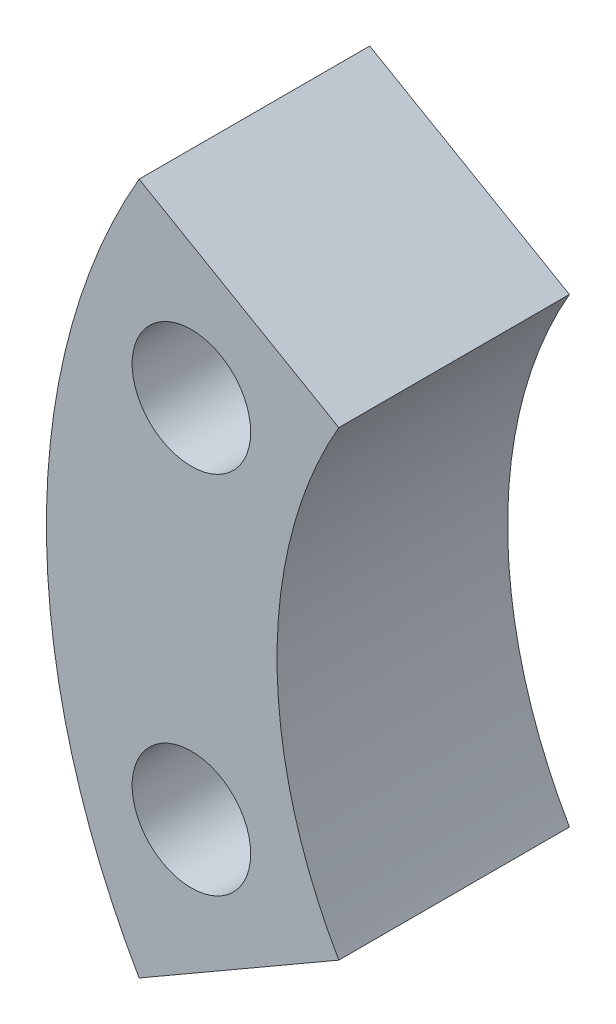
ISO-10303-21;
HEADER;
FILE_DESCRIPTION(('STEP AP214'),'2;1');
FILE_NAME('part.step','',(''),(''),'','','');
FILE_SCHEMA(('AUTOMOTIVE_DESIGN { 1 0 10303 214 1 1 1 1 }'));
ENDSEC;
DATA;
#1=APPLICATION_CONTEXT('core data for automotive mechanical design processes');
#2=APPLICATION_PROTOCOL_DEFINITION('international standard','automotive_design',2000,#1);
#3=PRODUCT_CONTEXT('',#1,'mechanical');
#4=PRODUCT('Part','Part','',(#3));
#5=PRODUCT_RELATED_PRODUCT_CATEGORY('part','',(#4));
#6=PRODUCT_DEFINITION_FORMATION('','',#4);
#7=PRODUCT_DEFINITION_CONTEXT('part definition',#1,'design');
#8=PRODUCT_DEFINITION('design','',#6,#7);
#9=PRODUCT_DEFINITION_SHAPE('','',#8);
#10=(LENGTH_UNIT() NAMED_UNIT(*) SI_UNIT(.MILLI.,.METRE.));
#11=(NAMED_UNIT(*) PLANE_ANGLE_UNIT() SI_UNIT($,.RADIAN.));
#12=(NAMED_UNIT(*) SI_UNIT($,.STERADIAN.) SOLID_ANGLE_UNIT());
#13=UNCERTAINTY_MEASURE_WITH_UNIT(LENGTH_MEASURE(1.E-05),#10,'distance_accuracy_value','');
#14=(GEOMETRIC_REPRESENTATION_CONTEXT(3) GLOBAL_UNCERTAINTY_ASSIGNED_CONTEXT((#13)) GLOBAL_UNIT_ASSIGNED_CONTEXT((#10,
#11,#12)) REPRESENTATION_CONTEXT('',''));
#15=CARTESIAN_POINT('',(0.,0.,0.));
#16=DIRECTION('',(0.,0.,1.));
#17=DIRECTION('',(1.,0.,0.));
#18=AXIS2_PLACEMENT_3D('',#15,#16,#17);
#19=CARTESIAN_POINT('',(0.,0.,6.35));
#20=DIRECTION('',(0.,0.,-1.));
#21=DIRECTION('',(-1.,0.,0.));
#22=AXIS2_PLACEMENT_3D('',#19,#20,#21);
#23=CYLINDRICAL_SURFACE('',#22,19.05);
#24=CARTESIAN_POINT('',(0.,0.,0.));
#25=DIRECTION('',(0.,0.,1.));
#26=DIRECTION('',(1.,0.,0.));
#27=AXIS2_PLACEMENT_3D('',#24,#25,#26);
#28=CIRCLE('',#27,19.05);
#29=CARTESIAN_POINT('',(-16.4977839420936,9.525,0.));
#30=VERTEX_POINT('',#29);
#31=CARTESIAN_POINT('',(-16.4977839420936,-9.525,0.));
#32=VERTEX_POINT('',#31);
#33=EDGE_CURVE('E113',#30,#32,#28,.T.);
#34=ORIENTED_EDGE('',*,*,#33,.T.);
#35=DIRECTION('',(0.,0.,-1.));
#36=VECTOR('',#35,1.);
#37=CARTESIAN_POINT('',(-16.4977839420936,-9.525,6.35));
#38=LINE('',#37,#36);
#39=CARTESIAN_POINT('',(-16.4977839420936,-9.525,6.35));
#40=VERTEX_POINT('',#39);
#41=EDGE_CURVE('E11',#40,#32,#38,.T.);
#42=ORIENTED_EDGE('',*,*,#41,.F.);
#43=CARTESIAN_POINT('',(0.,0.,6.35));
#44=DIRECTION('',(0.,0.,1.));
#45=DIRECTION('',(1.,0.,0.));
#46=AXIS2_PLACEMENT_3D('',#43,#44,#45);
#47=CIRCLE('',#46,19.05);
#48=CARTESIAN_POINT('',(-16.4977839420936,9.525,6.35));
#49=VERTEX_POINT('',#48);
#50=EDGE_CURVE('E97',#49,#40,#47,.T.);
#51=ORIENTED_EDGE('',*,*,#50,.F.);
#52=DIRECTION('',(0.,0.,-1.));
#53=VECTOR('',#52,1.);
#54=CARTESIAN_POINT('',(-16.4977839420936,9.525,6.35));
#55=LINE('',#54,#53);
#56=EDGE_CURVE('E109',#49,#30,#55,.T.);
#57=ORIENTED_EDGE('',*,*,#56,.T.);
#58=EDGE_LOOP('',(#34,#42,#51,#57));
#59=FACE_BOUND('',#58,.T.);
#60=ADVANCED_FACE('F45',(#59),#23,.T.);
#61=CARTESIAN_POINT('',(-16.4977839420936,-9.525,6.35));
#62=DIRECTION('',(-0.5,0.866025403784439,0.));
#63=DIRECTION('',(-0.866025403784439,-0.5,0.));
#64=AXIS2_PLACEMENT_3D('',#61,#62,#63);
#65=PLANE('',#64);
#66=DIRECTION('',(0.866025403784439,0.5,0.));
#67=VECTOR('',#66,1.);
#68=CARTESIAN_POINT('',(-16.4977839420936,-9.525,0.));
#69=LINE('',#68,#67);
#70=CARTESIAN_POINT('',(-10.9985226280624,-6.35,0.));
#71=VERTEX_POINT('',#70);
#72=EDGE_CURVE('E102',#32,#71,#69,.T.);
#73=ORIENTED_EDGE('',*,*,#72,.T.);
#74=DIRECTION('',(0.,0.,-1.));
#75=VECTOR('',#74,1.);
#76=CARTESIAN_POINT('',(-10.9985226280624,-6.35,6.35));
#77=LINE('',#76,#75);
#78=CARTESIAN_POINT('',(-10.9985226280624,-6.35,6.35));
#79=VERTEX_POINT('',#78);
#80=EDGE_CURVE('E54',#79,#71,#77,.T.);
#81=ORIENTED_EDGE('',*,*,#80,.F.);
#82=DIRECTION('',(0.866025403784439,0.5,0.));
#83=VECTOR('',#82,1.);
#84=CARTESIAN_POINT('',(-16.4977839420936,-9.525,6.35));
#85=LINE('',#84,#83);
#86=EDGE_CURVE('E92',#40,#79,#85,.T.);
#87=ORIENTED_EDGE('',*,*,#86,.F.);
#88=ORIENTED_EDGE('',*,*,#41,.T.);
#89=EDGE_LOOP('',(#73,#81,#87,#88));
#90=FACE_BOUND('',#89,.T.);
#91=ADVANCED_FACE('F101',(#90),#65,.F.);
#92=CARTESIAN_POINT('',(0.,0.,6.35));
#93=DIRECTION('',(0.,0.,-1.));
#94=DIRECTION('',(-1.,0.,0.));
#95=AXIS2_PLACEMENT_3D('',#92,#93,#94);
#96=CYLINDRICAL_SURFACE('',#95,12.7);
#97=CARTESIAN_POINT('',(0.,0.,0.));
#98=DIRECTION('',(0.,0.,-1.));
#99=DIRECTION('',(1.,0.,0.));
#100=AXIS2_PLACEMENT_3D('',#97,#98,#99);
#101=CIRCLE('',#100,12.7);
#102=CARTESIAN_POINT('',(-10.9985226280624,6.35,0.));
#103=VERTEX_POINT('',#102);
#104=EDGE_CURVE('E79',#71,#103,#101,.T.);
#105=ORIENTED_EDGE('',*,*,#104,.T.);
#106=DIRECTION('',(0.,0.,-1.));
#107=VECTOR('',#106,1.);
#108=CARTESIAN_POINT('',(-10.9985226280624,6.35,6.35));
#109=LINE('',#108,#107);
#110=CARTESIAN_POINT('',(-10.9985226280624,6.35,6.35));
#111=VERTEX_POINT('',#110);
#112=EDGE_CURVE('E104',#111,#103,#109,.T.);
#113=ORIENTED_EDGE('',*,*,#112,.F.);
#114=CARTESIAN_POINT('',(0.,0.,6.35));
#115=DIRECTION('',(0.,0.,-1.));
#116=DIRECTION('',(1.,0.,0.));
#117=AXIS2_PLACEMENT_3D('',#114,#115,#116);
#118=CIRCLE('',#117,12.7);
#119=EDGE_CURVE('E95',#79,#111,#118,.T.);
#120=ORIENTED_EDGE('',*,*,#119,.F.);
#121=ORIENTED_EDGE('',*,*,#80,.T.);
#122=EDGE_LOOP('',(#105,#113,#120,#121));
#123=FACE_BOUND('',#122,.T.);
#124=ADVANCED_FACE('F105',(#123),#96,.F.);
#125=CARTESIAN_POINT('',(-16.4977839420936,9.525,6.35));
#126=DIRECTION('',(-0.5,-0.866025403784439,0.));
#127=DIRECTION('',(0.866025403784439,-0.5,0.));
#128=AXIS2_PLACEMENT_3D('',#125,#126,#127);
#129=PLANE('',#128);
#130=DIRECTION('',(-0.866025403784439,0.5,0.));
#131=VECTOR('',#130,1.);
#132=CARTESIAN_POINT('',(-16.4977839420936,9.525,0.));
#133=LINE('',#132,#131);
#134=EDGE_CURVE('E85',#103,#30,#133,.T.);
#135=ORIENTED_EDGE('',*,*,#134,.T.);
#136=ORIENTED_EDGE('',*,*,#56,.F.);
#137=DIRECTION('',(-0.866025403784439,0.5,0.));
#138=VECTOR('',#137,1.);
#139=CARTESIAN_POINT('',(-16.4977839420936,9.525,6.35));
#140=LINE('',#139,#138);
#141=EDGE_CURVE('E62',#111,#49,#140,.T.);
#142=ORIENTED_EDGE('',*,*,#141,.F.);
#143=ORIENTED_EDGE('',*,*,#112,.T.);
#144=EDGE_LOOP('',(#135,#136,#142,#143));
#145=FACE_BOUND('',#144,.T.);
#146=ADVANCED_FACE('F127',(#145),#129,.F.);
#147=CARTESIAN_POINT('',(0.,0.,6.35));
#148=DIRECTION('',(0.,0.,1.));
#149=DIRECTION('',(1.,0.,0.));
#150=AXIS2_PLACEMENT_3D('',#147,#148,#149);
#151=PLANE('',#150);
#152=CARTESIAN_POINT('',(-15.0578841816037,5.027499276321,6.35));
#153=DIRECTION('',(0.,0.,1.));
#154=DIRECTION('',(1.,0.,0.));
#155=AXIS2_PLACEMENT_3D('',#152,#153,#154);
#156=CIRCLE('',#155,1.63195);
#157=CARTESIAN_POINT('',(-13.4259341816037,5.027499276321,6.35));
#158=VERTEX_POINT('',#157);
#159=EDGE_CURVE('E138',#158,#158,#156,.T.);
#160=ORIENTED_EDGE('',*,*,#159,.F.);
#161=EDGE_LOOP('',(#160));
#162=FACE_BOUND('',#161,.T.);
#163=CARTESIAN_POINT('',(-15.0578841816037,-5.027499276321,6.35));
#164=DIRECTION('',(0.,0.,1.));
#165=DIRECTION('',(1.,0.,0.));
#166=AXIS2_PLACEMENT_3D('',#163,#164,#165);
#167=CIRCLE('',#166,1.63195);
#168=CARTESIAN_POINT('',(-13.4259341816037,-5.027499276321,6.35));
#169=VERTEX_POINT('',#168);
#170=EDGE_CURVE('E134',#169,#169,#167,.T.);
#171=ORIENTED_EDGE('',*,*,#170,.F.);
#172=EDGE_LOOP('',(#171));
#173=FACE_BOUND('',#172,.T.);
#174=ORIENTED_EDGE('',*,*,#50,.T.);
#175=ORIENTED_EDGE('',*,*,#86,.T.);
#176=ORIENTED_EDGE('',*,*,#119,.T.);
#177=ORIENTED_EDGE('',*,*,#141,.T.);
#178=EDGE_LOOP('',(#174,#175,#176,#177));
#179=FACE_BOUND('',#178,.T.);
#180=ADVANCED_FACE('F93',(#162,#173,#179),#151,.T.);
#181=CARTESIAN_POINT('',(0.,0.,0.));
#182=DIRECTION('',(0.,0.,1.));
#183=DIRECTION('',(1.,0.,0.));
#184=AXIS2_PLACEMENT_3D('',#181,#182,#183);
#185=PLANE('',#184);
#186=CARTESIAN_POINT('',(-15.0578841816037,5.027499276321,0.));
#187=DIRECTION('',(0.,0.,1.));
#188=DIRECTION('',(1.,0.,0.));
#189=AXIS2_PLACEMENT_3D('',#186,#187,#188);
#190=CIRCLE('',#189,1.63195);
#191=CARTESIAN_POINT('',(-13.4259341816037,5.027499276321,0.));
#192=VERTEX_POINT('',#191);
#193=EDGE_CURVE('E117',#192,#192,#190,.F.);
#194=ORIENTED_EDGE('',*,*,#193,.F.);
#195=EDGE_LOOP('',(#194));
#196=FACE_BOUND('',#195,.T.);
#197=CARTESIAN_POINT('',(-15.0578841816037,-5.027499276321,0.));
#198=DIRECTION('',(0.,0.,1.));
#199=DIRECTION('',(1.,0.,0.));
#200=AXIS2_PLACEMENT_3D('',#197,#198,#199);
#201=CIRCLE('',#200,1.63195);
#202=CARTESIAN_POINT('',(-13.4259341816037,-5.027499276321,0.));
#203=VERTEX_POINT('',#202);
#204=EDGE_CURVE('E139',#203,#203,#201,.F.);
#205=ORIENTED_EDGE('',*,*,#204,.F.);
#206=EDGE_LOOP('',(#205));
#207=FACE_BOUND('',#206,.T.);
#208=ORIENTED_EDGE('',*,*,#33,.F.);
#209=ORIENTED_EDGE('',*,*,#134,.F.);
#210=ORIENTED_EDGE('',*,*,#104,.F.);
#211=ORIENTED_EDGE('',*,*,#72,.F.);
#212=EDGE_LOOP('',(#208,#209,#210,#211));
#213=FACE_BOUND('',#212,.T.);
#214=ADVANCED_FACE('F130',(#196,#207,#213),#185,.F.);
#215=CARTESIAN_POINT('',(-15.0578841816037,-5.027499276321,-0.00100000000000013));
#216=DIRECTION('',(0.,0.,1.));
#217=DIRECTION('',(1.,0.,0.));
#218=AXIS2_PLACEMENT_3D('',#215,#216,#217);
#219=CYLINDRICAL_SURFACE('',#218,1.63195);
#220=ORIENTED_EDGE('',*,*,#170,.T.);
#221=EDGE_LOOP('',(#220));
#222=FACE_BOUND('',#221,.T.);
#223=ORIENTED_EDGE('',*,*,#204,.T.);
#224=EDGE_LOOP('',(#223));
#225=FACE_BOUND('',#224,.T.);
#226=ADVANCED_FACE('F158',(#222,#225),#219,.F.);
#227=CARTESIAN_POINT('',(-15.0578841816037,5.027499276321,-0.00100000000000013));
#228=DIRECTION('',(0.,0.,1.));
#229=DIRECTION('',(1.,0.,0.));
#230=AXIS2_PLACEMENT_3D('',#227,#228,#229);
#231=CYLINDRICAL_SURFACE('',#230,1.63195);
#232=ORIENTED_EDGE('',*,*,#159,.T.);
#233=EDGE_LOOP('',(#232));
#234=FACE_BOUND('',#233,.T.);
#235=ORIENTED_EDGE('',*,*,#193,.T.);
#236=EDGE_LOOP('',(#235));
#237=FACE_BOUND('',#236,.T.);
#238=ADVANCED_FACE('F150',(#234,#237),#231,.F.);
#239=CLOSED_SHELL('',(#60,#91,#124,#146,#180,#214,#226,#238));
#240=MANIFOLD_SOLID_BREP('B2',#239);
#241=ADVANCED_BREP_SHAPE_REPRESENTATION('',(#18,#240),#14);
#242=SHAPE_DEFINITION_REPRESENTATION(#9,#241);
ENDSEC;
END-ISO-10303-21;
